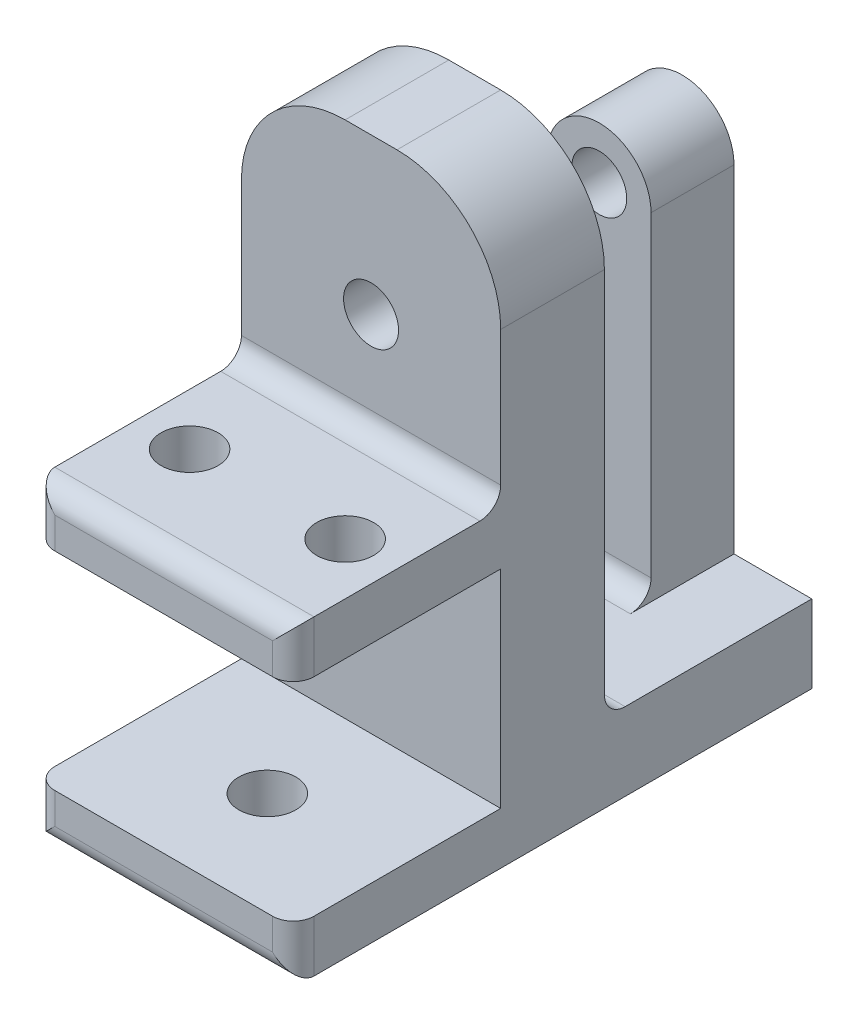
ISO-10303-21;
HEADER;
FILE_DESCRIPTION(('STEP AP214'),'2;1');
FILE_NAME('part.step','',(''),(''),'','','');
FILE_SCHEMA(('AUTOMOTIVE_DESIGN { 1 0 10303 214 1 1 1 1 }'));
ENDSEC;
DATA;
#1=APPLICATION_CONTEXT('core data for automotive mechanical design processes');
#2=APPLICATION_PROTOCOL_DEFINITION('international standard','automotive_design',2000,#1);
#3=PRODUCT_CONTEXT('',#1,'mechanical');
#4=PRODUCT('Part','Part','',(#3));
#5=PRODUCT_RELATED_PRODUCT_CATEGORY('part','',(#4));
#6=PRODUCT_DEFINITION_FORMATION('','',#4);
#7=PRODUCT_DEFINITION_CONTEXT('part definition',#1,'design');
#8=PRODUCT_DEFINITION('design','',#6,#7);
#9=PRODUCT_DEFINITION_SHAPE('','',#8);
#10=(LENGTH_UNIT() NAMED_UNIT(*) SI_UNIT(.MILLI.,.METRE.));
#11=(NAMED_UNIT(*) PLANE_ANGLE_UNIT() SI_UNIT($,.RADIAN.));
#12=(NAMED_UNIT(*) SI_UNIT($,.STERADIAN.) SOLID_ANGLE_UNIT());
#13=UNCERTAINTY_MEASURE_WITH_UNIT(LENGTH_MEASURE(1.E-05),#10,'distance_accuracy_value','');
#14=(GEOMETRIC_REPRESENTATION_CONTEXT(3) GLOBAL_UNCERTAINTY_ASSIGNED_CONTEXT((#13)) GLOBAL_UNIT_ASSIGNED_CONTEXT((#10,
#11,#12)) REPRESENTATION_CONTEXT('',''));
#15=CARTESIAN_POINT('',(0.,0.,0.));
#16=DIRECTION('',(0.,0.,1.));
#17=DIRECTION('',(1.,0.,0.));
#18=AXIS2_PLACEMENT_3D('',#15,#16,#17);
#19=CARTESIAN_POINT('',(10.,40.,10.));
#20=DIRECTION('',(0.,0.,-1.));
#21=DIRECTION('',(-1.,0.,0.));
#22=AXIS2_PLACEMENT_3D('',#19,#20,#21);
#23=PLANE('',#22);
#24=DIRECTION('',(1.,0.,0.));
#25=VECTOR('',#24,1.);
#26=CARTESIAN_POINT('',(0.,20.,10.));
#27=LINE('',#26,#25);
#28=CARTESIAN_POINT('',(0.,20.,10.));
#29=VERTEX_POINT('',#28);
#30=CARTESIAN_POINT('',(25.,20.,10.));
#31=VERTEX_POINT('',#30);
#32=EDGE_CURVE('E297',#29,#31,#27,.T.);
#33=ORIENTED_EDGE('',*,*,#32,.F.);
#34=DIRECTION('',(0.,-1.,0.));
#35=VECTOR('',#34,1.);
#36=CARTESIAN_POINT('',(0.,0.,10.));
#37=LINE('',#36,#35);
#38=CARTESIAN_POINT('',(0.,0.,10.));
#39=VERTEX_POINT('',#38);
#40=EDGE_CURVE('E315',#29,#39,#37,.T.);
#41=ORIENTED_EDGE('',*,*,#40,.T.);
#42=DIRECTION('',(1.,0.,0.));
#43=VECTOR('',#42,1.);
#44=CARTESIAN_POINT('',(0.,0.,10.));
#45=LINE('',#44,#43);
#46=CARTESIAN_POINT('',(25.,0.,10.));
#47=VERTEX_POINT('',#46);
#48=EDGE_CURVE('E314',#39,#47,#45,.T.);
#49=ORIENTED_EDGE('',*,*,#48,.T.);
#50=DIRECTION('',(0.,1.,0.));
#51=VECTOR('',#50,1.);
#52=CARTESIAN_POINT('',(25.,0.,10.));
#53=LINE('',#52,#51);
#54=EDGE_CURVE('E319',#47,#31,#53,.T.);
#55=ORIENTED_EDGE('',*,*,#54,.T.);
#56=EDGE_LOOP('',(#33,#41,#49,#55));
#57=FACE_BOUND('',#56,.T.);
#58=ADVANCED_FACE('F37',(#57),#23,.F.);
#59=CARTESIAN_POINT('',(0.,40.,10.));
#60=VERTEX_POINT('',#59);
#61=CARTESIAN_POINT('',(0.,27.,10.));
#62=VERTEX_POINT('',#61);
#63=EDGE_CURVE('E311',#60,#62,#37,.T.);
#64=ORIENTED_EDGE('',*,*,#63,.T.);
#65=DIRECTION('',(1.,0.,0.));
#66=VECTOR('',#65,1.);
#67=CARTESIAN_POINT('',(10.,27.,10.));
#68=LINE('',#67,#66);
#69=CARTESIAN_POINT('',(25.,27.,10.));
#70=VERTEX_POINT('',#69);
#71=EDGE_CURVE('E368',#62,#70,#68,.T.);
#72=ORIENTED_EDGE('',*,*,#71,.T.);
#73=CARTESIAN_POINT('',(25.,40.,10.));
#74=VERTEX_POINT('',#73);
#75=EDGE_CURVE('E318',#70,#74,#53,.T.);
#76=ORIENTED_EDGE('',*,*,#75,.T.);
#77=CARTESIAN_POINT('',(15.,40.,10.));
#78=DIRECTION('',(0.,0.,1.));
#79=DIRECTION('',(-1.,0.,0.));
#80=AXIS2_PLACEMENT_3D('',#77,#78,#79);
#81=CIRCLE('',#80,10.);
#82=CARTESIAN_POINT('',(15.,50.,10.));
#83=VERTEX_POINT('',#82);
#84=EDGE_CURVE('E322',#74,#83,#81,.T.);
#85=ORIENTED_EDGE('',*,*,#84,.T.);
#86=DIRECTION('',(-1.,0.,0.));
#87=VECTOR('',#86,1.);
#88=CARTESIAN_POINT('',(10.,50.,10.));
#89=LINE('',#88,#87);
#90=CARTESIAN_POINT('',(10.,50.,10.));
#91=VERTEX_POINT('',#90);
#92=EDGE_CURVE('E324',#83,#91,#89,.T.);
#93=ORIENTED_EDGE('',*,*,#92,.T.);
#94=CARTESIAN_POINT('',(10.,40.,10.));
#95=DIRECTION('',(0.,0.,1.));
#96=DIRECTION('',(-1.,0.,0.));
#97=AXIS2_PLACEMENT_3D('',#94,#95,#96);
#98=CIRCLE('',#97,10.);
#99=EDGE_CURVE('E326',#91,#60,#98,.T.);
#100=ORIENTED_EDGE('',*,*,#99,.T.);
#101=EDGE_LOOP('',(#64,#72,#76,#85,#93,#100));
#102=FACE_BOUND('',#101,.T.);
#103=CARTESIAN_POINT('',(12.5,35.,10.));
#104=DIRECTION('',(0.,0.,1.));
#105=DIRECTION('',(1.,0.,0.));
#106=AXIS2_PLACEMENT_3D('',#103,#104,#105);
#107=CIRCLE('',#106,2.65);
#108=CARTESIAN_POINT('',(15.15,35.,10.));
#109=VERTEX_POINT('',#108);
#110=EDGE_CURVE('E305',#109,#109,#107,.T.);
#111=ORIENTED_EDGE('',*,*,#110,.F.);
#112=EDGE_LOOP('',(#111));
#113=FACE_BOUND('',#112,.T.);
#114=ADVANCED_FACE('F501',(#102,#113),#23,.F.);
#115=CARTESIAN_POINT('',(10.,40.,0.));
#116=DIRECTION('',(0.,0.,-1.));
#117=DIRECTION('',(-1.,0.,0.));
#118=AXIS2_PLACEMENT_3D('',#115,#116,#117);
#119=PLANE('',#118);
#120=DIRECTION('',(0.,1.,0.));
#121=VECTOR('',#120,1.);
#122=CARTESIAN_POINT('',(25.,0.,0.));
#123=LINE('',#122,#121);
#124=CARTESIAN_POINT('',(25.,4.5,0.));
#125=VERTEX_POINT('',#124);
#126=CARTESIAN_POINT('',(25.,40.,0.));
#127=VERTEX_POINT('',#126);
#128=EDGE_CURVE('E331',#125,#127,#123,.T.);
#129=ORIENTED_EDGE('',*,*,#128,.F.);
#130=DIRECTION('',(1.,0.,0.));
#131=VECTOR('',#130,1.);
#132=CARTESIAN_POINT('',(10.,4.5,0.));
#133=LINE('',#132,#131);
#134=CARTESIAN_POINT('',(0.,4.5,0.));
#135=VERTEX_POINT('',#134);
#136=EDGE_CURVE('E356',#125,#135,#133,.F.);
#137=ORIENTED_EDGE('',*,*,#136,.T.);
#138=DIRECTION('',(0.,-1.,0.));
#139=VECTOR('',#138,1.);
#140=CARTESIAN_POINT('',(0.,0.,0.));
#141=LINE('',#140,#139);
#142=CARTESIAN_POINT('',(0.,40.,0.));
#143=VERTEX_POINT('',#142);
#144=EDGE_CURVE('E308',#143,#135,#141,.T.);
#145=ORIENTED_EDGE('',*,*,#144,.F.);
#146=CARTESIAN_POINT('',(10.,40.,0.));
#147=DIRECTION('',(0.,0.,1.));
#148=DIRECTION('',(-1.,0.,0.));
#149=AXIS2_PLACEMENT_3D('',#146,#147,#148);
#150=CIRCLE('',#149,10.);
#151=CARTESIAN_POINT('',(10.,50.,0.));
#152=VERTEX_POINT('',#151);
#153=EDGE_CURVE('E337',#152,#143,#150,.T.);
#154=ORIENTED_EDGE('',*,*,#153,.F.);
#155=DIRECTION('',(-1.,0.,0.));
#156=VECTOR('',#155,1.);
#157=CARTESIAN_POINT('',(10.,50.,0.));
#158=LINE('',#157,#156);
#159=CARTESIAN_POINT('',(15.,50.,0.));
#160=VERTEX_POINT('',#159);
#161=EDGE_CURVE('E335',#160,#152,#158,.T.);
#162=ORIENTED_EDGE('',*,*,#161,.F.);
#163=CARTESIAN_POINT('',(15.,40.,0.));
#164=DIRECTION('',(0.,0.,1.));
#165=DIRECTION('',(-1.,0.,0.));
#166=AXIS2_PLACEMENT_3D('',#163,#164,#165);
#167=CIRCLE('',#166,10.);
#168=EDGE_CURVE('E333',#127,#160,#167,.T.);
#169=ORIENTED_EDGE('',*,*,#168,.F.);
#170=EDGE_LOOP('',(#129,#137,#145,#154,#162,#169));
#171=FACE_BOUND('',#170,.T.);
#172=CARTESIAN_POINT('',(12.5,35.,0.));
#173=DIRECTION('',(0.,0.,1.));
#174=DIRECTION('',(1.,0.,0.));
#175=AXIS2_PLACEMENT_3D('',#172,#173,#174);
#176=CIRCLE('',#175,2.65);
#177=CARTESIAN_POINT('',(15.15,35.,0.));
#178=VERTEX_POINT('',#177);
#179=EDGE_CURVE('E295',#178,#178,#176,.T.);
#180=ORIENTED_EDGE('',*,*,#179,.T.);
#181=EDGE_LOOP('',(#180));
#182=FACE_BOUND('',#181,.T.);
#183=ADVANCED_FACE('F506',(#171,#182),#119,.T.);
#184=CARTESIAN_POINT('',(0.,0.,10.));
#185=DIRECTION('',(1.,0.,0.));
#186=DIRECTION('',(0.,0.,-1.));
#187=AXIS2_PLACEMENT_3D('',#184,#185,#186);
#188=PLANE('',#187);
#189=DIRECTION('',(0.,0.,-1.));
#190=VECTOR('',#189,1.);
#191=CARTESIAN_POINT('',(0.,20.,10.));
#192=LINE('',#191,#190);
#193=CARTESIAN_POINT('',(0.,20.,28.));
#194=VERTEX_POINT('',#193);
#195=EDGE_CURVE('E283',#194,#29,#192,.T.);
#196=ORIENTED_EDGE('',*,*,#195,.F.);
#197=DIRECTION('',(0.,-1.,0.));
#198=VECTOR('',#197,1.);
#199=CARTESIAN_POINT('',(0.,25.,28.));
#200=LINE('',#199,#198);
#201=CARTESIAN_POINT('',(0.,25.,28.));
#202=VERTEX_POINT('',#201);
#203=EDGE_CURVE('E400',#194,#202,#200,.F.);
#204=ORIENTED_EDGE('',*,*,#203,.T.);
#205=DIRECTION('',(0.,0.,-1.));
#206=VECTOR('',#205,1.);
#207=CARTESIAN_POINT('',(0.,25.,10.));
#208=LINE('',#207,#206);
#209=CARTESIAN_POINT('',(0.,25.,12.));
#210=VERTEX_POINT('',#209);
#211=EDGE_CURVE('E289',#202,#210,#208,.T.);
#212=ORIENTED_EDGE('',*,*,#211,.T.);
#213=CARTESIAN_POINT('',(0.,27.,12.));
#214=DIRECTION('',(1.,0.,0.));
#215=DIRECTION('',(0.,0.,-1.));
#216=AXIS2_PLACEMENT_3D('',#213,#214,#215);
#217=CIRCLE('',#216,2.);
#218=EDGE_CURVE('E384',#210,#62,#217,.T.);
#219=ORIENTED_EDGE('',*,*,#218,.T.);
#220=ORIENTED_EDGE('',*,*,#63,.F.);
#221=DIRECTION('',(0.,0.,-1.));
#222=VECTOR('',#221,1.);
#223=CARTESIAN_POINT('',(0.,40.,10.));
#224=LINE('',#223,#222);
#225=EDGE_CURVE('E328',#60,#143,#224,.T.);
#226=ORIENTED_EDGE('',*,*,#225,.T.);
#227=ORIENTED_EDGE('',*,*,#144,.T.);
#228=CARTESIAN_POINT('',(0.,4.5,-2.));
#229=DIRECTION('',(1.,0.,0.));
#230=DIRECTION('',(0.,0.,-1.));
#231=AXIS2_PLACEMENT_3D('',#228,#229,#230);
#232=CIRCLE('',#231,2.);
#233=CARTESIAN_POINT('',(0.,2.5,-2.));
#234=VERTEX_POINT('',#233);
#235=EDGE_CURVE('E362',#135,#234,#232,.T.);
#236=ORIENTED_EDGE('',*,*,#235,.T.);
#237=DIRECTION('',(0.,0.,1.));
#238=VECTOR('',#237,1.);
#239=CARTESIAN_POINT('',(0.,2.5,-20.));
#240=LINE('',#239,#238);
#241=CARTESIAN_POINT('',(0.,2.5,-20.));
#242=VERTEX_POINT('',#241);
#243=EDGE_CURVE('E273',#242,#234,#240,.T.);
#244=ORIENTED_EDGE('',*,*,#243,.F.);
#245=DIRECTION('',(0.,1.,0.));
#246=VECTOR('',#245,1.);
#247=CARTESIAN_POINT('',(0.,-5.,-20.));
#248=LINE('',#247,#246);
#249=CARTESIAN_POINT('',(0.,-5.,-20.));
#250=VERTEX_POINT('',#249);
#251=EDGE_CURVE('E264',#250,#242,#248,.T.);
#252=ORIENTED_EDGE('',*,*,#251,.F.);
#253=DIRECTION('',(0.,0.,-1.));
#254=VECTOR('',#253,1.);
#255=CARTESIAN_POINT('',(0.,-5.,10.));
#256=LINE('',#255,#254);
#257=CARTESIAN_POINT('',(0.,-5.,28.));
#258=VERTEX_POINT('',#257);
#259=EDGE_CURVE('E277',#258,#250,#256,.T.);
#260=ORIENTED_EDGE('',*,*,#259,.F.);
#261=DIRECTION('',(0.,1.,0.));
#262=VECTOR('',#261,1.);
#263=CARTESIAN_POINT('',(0.,0.,28.));
#264=LINE('',#263,#262);
#265=CARTESIAN_POINT('',(0.,0.,28.));
#266=VERTEX_POINT('',#265);
#267=EDGE_CURVE('E397',#258,#266,#264,.T.);
#268=ORIENTED_EDGE('',*,*,#267,.T.);
#269=DIRECTION('',(0.,0.,-1.));
#270=VECTOR('',#269,1.);
#271=CARTESIAN_POINT('',(0.,0.,30.));
#272=LINE('',#271,#270);
#273=EDGE_CURVE('E280',#266,#39,#272,.T.);
#274=ORIENTED_EDGE('',*,*,#273,.T.);
#275=ORIENTED_EDGE('',*,*,#40,.F.);
#276=EDGE_LOOP('',(#196,#204,#212,#219,#220,#226,#227,#236,#244,#252,#260,#268,#274,#275));
#277=FACE_BOUND('',#276,.T.);
#278=ADVANCED_FACE('F443',(#277),#188,.F.);
#279=CARTESIAN_POINT('',(25.,0.,10.));
#280=DIRECTION('',(-1.,0.,0.));
#281=DIRECTION('',(0.,-1.,0.));
#282=AXIS2_PLACEMENT_3D('',#279,#280,#281);
#283=PLANE('',#282);
#284=DIRECTION('',(0.,0.,1.));
#285=VECTOR('',#284,1.);
#286=CARTESIAN_POINT('',(25.,25.,10.));
#287=LINE('',#286,#285);
#288=CARTESIAN_POINT('',(25.,25.,12.));
#289=VERTEX_POINT('',#288);
#290=CARTESIAN_POINT('',(25.,25.,28.));
#291=VERTEX_POINT('',#290);
#292=EDGE_CURVE('E291',#289,#291,#287,.T.);
#293=ORIENTED_EDGE('',*,*,#292,.T.);
#294=DIRECTION('',(0.,-1.,0.));
#295=VECTOR('',#294,1.);
#296=CARTESIAN_POINT('',(25.,20.,28.));
#297=LINE('',#296,#295);
#298=CARTESIAN_POINT('',(25.,20.,28.));
#299=VERTEX_POINT('',#298);
#300=EDGE_CURVE('E404',#291,#299,#297,.T.);
#301=ORIENTED_EDGE('',*,*,#300,.T.);
#302=DIRECTION('',(0.,0.,1.));
#303=VECTOR('',#302,1.);
#304=CARTESIAN_POINT('',(25.,20.,10.));
#305=LINE('',#304,#303);
#306=EDGE_CURVE('E300',#31,#299,#305,.T.);
#307=ORIENTED_EDGE('',*,*,#306,.F.);
#308=ORIENTED_EDGE('',*,*,#54,.F.);
#309=DIRECTION('',(0.,0.,1.));
#310=VECTOR('',#309,1.);
#311=CARTESIAN_POINT('',(25.,0.,10.));
#312=LINE('',#311,#310);
#313=CARTESIAN_POINT('',(25.,0.,28.));
#314=VERTEX_POINT('',#313);
#315=EDGE_CURVE('E276',#47,#314,#312,.T.);
#316=ORIENTED_EDGE('',*,*,#315,.T.);
#317=DIRECTION('',(0.,1.,0.));
#318=VECTOR('',#317,1.);
#319=CARTESIAN_POINT('',(25.,0.,28.));
#320=LINE('',#319,#318);
#321=CARTESIAN_POINT('',(25.,-5.,28.));
#322=VERTEX_POINT('',#321);
#323=EDGE_CURVE('E402',#314,#322,#320,.F.);
#324=ORIENTED_EDGE('',*,*,#323,.T.);
#325=DIRECTION('',(0.,0.,1.));
#326=VECTOR('',#325,1.);
#327=CARTESIAN_POINT('',(25.,-5.,0.));
#328=LINE('',#327,#326);
#329=CARTESIAN_POINT('',(25.,-5.,-20.));
#330=VERTEX_POINT('',#329);
#331=EDGE_CURVE('E279',#330,#322,#328,.T.);
#332=ORIENTED_EDGE('',*,*,#331,.F.);
#333=DIRECTION('',(0.,-1.,0.));
#334=VECTOR('',#333,1.);
#335=CARTESIAN_POINT('',(25.,-5.,-20.));
#336=LINE('',#335,#334);
#337=CARTESIAN_POINT('',(25.,2.5,-20.));
#338=VERTEX_POINT('',#337);
#339=EDGE_CURVE('E256',#338,#330,#336,.T.);
#340=ORIENTED_EDGE('',*,*,#339,.F.);
#341=DIRECTION('',(0.,0.,1.));
#342=VECTOR('',#341,1.);
#343=CARTESIAN_POINT('',(25.,2.5,-20.));
#344=LINE('',#343,#342);
#345=CARTESIAN_POINT('',(25.,2.5,-2.));
#346=VERTEX_POINT('',#345);
#347=EDGE_CURVE('E270',#338,#346,#344,.T.);
#348=ORIENTED_EDGE('',*,*,#347,.T.);
#349=CARTESIAN_POINT('',(25.,4.5,-2.));
#350=DIRECTION('',(-1.,0.,0.));
#351=DIRECTION('',(0.,-1.,0.));
#352=AXIS2_PLACEMENT_3D('',#349,#350,#351);
#353=CIRCLE('',#352,2.);
#354=EDGE_CURVE('E360',#346,#125,#353,.T.);
#355=ORIENTED_EDGE('',*,*,#354,.T.);
#356=ORIENTED_EDGE('',*,*,#128,.T.);
#357=DIRECTION('',(0.,0.,-1.));
#358=VECTOR('',#357,1.);
#359=CARTESIAN_POINT('',(25.,40.,10.));
#360=LINE('',#359,#358);
#361=EDGE_CURVE('E347',#74,#127,#360,.T.);
#362=ORIENTED_EDGE('',*,*,#361,.F.);
#363=ORIENTED_EDGE('',*,*,#75,.F.);
#364=CARTESIAN_POINT('',(25.,27.,12.));
#365=DIRECTION('',(-1.,0.,0.));
#366=DIRECTION('',(0.,-1.,0.));
#367=AXIS2_PLACEMENT_3D('',#364,#365,#366);
#368=CIRCLE('',#367,2.);
#369=EDGE_CURVE('E382',#70,#289,#368,.T.);
#370=ORIENTED_EDGE('',*,*,#369,.T.);
#371=EDGE_LOOP('',(#293,#301,#307,#308,#316,#324,#332,#340,#348,#355,#356,#362,#363,#370));
#372=FACE_BOUND('',#371,.T.);
#373=ADVANCED_FACE('F456',(#372),#283,.F.);
#374=CARTESIAN_POINT('',(15.,40.,10.));
#375=DIRECTION('',(0.,0.,-1.));
#376=DIRECTION('',(-1.,0.,0.));
#377=AXIS2_PLACEMENT_3D('',#374,#375,#376);
#378=CYLINDRICAL_SURFACE('',#377,10.);
#379=ORIENTED_EDGE('',*,*,#168,.T.);
#380=DIRECTION('',(0.,0.,-1.));
#381=VECTOR('',#380,1.);
#382=CARTESIAN_POINT('',(15.,50.,10.));
#383=LINE('',#382,#381);
#384=EDGE_CURVE('E344',#83,#160,#383,.T.);
#385=ORIENTED_EDGE('',*,*,#384,.F.);
#386=ORIENTED_EDGE('',*,*,#84,.F.);
#387=ORIENTED_EDGE('',*,*,#361,.T.);
#388=EDGE_LOOP('',(#379,#385,#386,#387));
#389=FACE_BOUND('',#388,.T.);
#390=ADVANCED_FACE('F518',(#389),#378,.T.);
#391=CARTESIAN_POINT('',(10.,50.,10.));
#392=DIRECTION('',(0.,-1.,0.));
#393=DIRECTION('',(0.,0.,-1.));
#394=AXIS2_PLACEMENT_3D('',#391,#392,#393);
#395=PLANE('',#394);
#396=ORIENTED_EDGE('',*,*,#161,.T.);
#397=DIRECTION('',(0.,0.,-1.));
#398=VECTOR('',#397,1.);
#399=CARTESIAN_POINT('',(10.,50.,10.));
#400=LINE('',#399,#398);
#401=EDGE_CURVE('E341',#91,#152,#400,.T.);
#402=ORIENTED_EDGE('',*,*,#401,.F.);
#403=ORIENTED_EDGE('',*,*,#92,.F.);
#404=ORIENTED_EDGE('',*,*,#384,.T.);
#405=EDGE_LOOP('',(#396,#402,#403,#404));
#406=FACE_BOUND('',#405,.T.);
#407=ADVANCED_FACE('F514',(#406),#395,.F.);
#408=CARTESIAN_POINT('',(10.,40.,10.));
#409=DIRECTION('',(0.,0.,-1.));
#410=DIRECTION('',(-1.,0.,0.));
#411=AXIS2_PLACEMENT_3D('',#408,#409,#410);
#412=CYLINDRICAL_SURFACE('',#411,10.);
#413=ORIENTED_EDGE('',*,*,#153,.T.);
#414=ORIENTED_EDGE('',*,*,#225,.F.);
#415=ORIENTED_EDGE('',*,*,#99,.F.);
#416=ORIENTED_EDGE('',*,*,#401,.T.);
#417=EDGE_LOOP('',(#413,#414,#415,#416));
#418=FACE_BOUND('',#417,.T.);
#419=ADVANCED_FACE('F496',(#418),#412,.T.);
#420=CARTESIAN_POINT('',(12.5,35.,10.));
#421=DIRECTION('',(0.,0.,-1.));
#422=DIRECTION('',(-1.,0.,0.));
#423=AXIS2_PLACEMENT_3D('',#420,#421,#422);
#424=CYLINDRICAL_SURFACE('',#423,2.65);
#425=ORIENTED_EDGE('',*,*,#110,.T.);
#426=EDGE_LOOP('',(#425));
#427=FACE_BOUND('',#426,.T.);
#428=ORIENTED_EDGE('',*,*,#179,.F.);
#429=EDGE_LOOP('',(#428));
#430=FACE_BOUND('',#429,.T.);
#431=ADVANCED_FACE('F488',(#427,#430),#424,.F.);
#432=CARTESIAN_POINT('',(0.,25.,30.));
#433=DIRECTION('',(0.,0.,1.));
#434=DIRECTION('',(1.,0.,0.));
#435=AXIS2_PLACEMENT_3D('',#432,#433,#434);
#436=PLANE('',#435);
#437=DIRECTION('',(-1.,0.,0.));
#438=VECTOR('',#437,1.);
#439=CARTESIAN_POINT('',(0.,23.,30.));
#440=LINE('',#439,#438);
#441=CARTESIAN_POINT('',(23.,23.,30.));
#442=VERTEX_POINT('',#441);
#443=CARTESIAN_POINT('',(2.,23.,30.));
#444=VERTEX_POINT('',#443);
#445=EDGE_CURVE('E386',#442,#444,#440,.T.);
#446=ORIENTED_EDGE('',*,*,#445,.T.);
#447=DIRECTION('',(0.,-1.,0.));
#448=VECTOR('',#447,1.);
#449=CARTESIAN_POINT('',(2.,20.,30.));
#450=LINE('',#449,#448);
#451=CARTESIAN_POINT('',(2.,20.,30.));
#452=VERTEX_POINT('',#451);
#453=EDGE_CURVE('E390',#444,#452,#450,.T.);
#454=ORIENTED_EDGE('',*,*,#453,.T.);
#455=DIRECTION('',(-1.,0.,0.));
#456=VECTOR('',#455,1.);
#457=CARTESIAN_POINT('',(0.,20.,30.));
#458=LINE('',#457,#456);
#459=CARTESIAN_POINT('',(23.,20.,30.));
#460=VERTEX_POINT('',#459);
#461=EDGE_CURVE('E292',#460,#452,#458,.T.);
#462=ORIENTED_EDGE('',*,*,#461,.F.);
#463=DIRECTION('',(0.,-1.,0.));
#464=VECTOR('',#463,1.);
#465=CARTESIAN_POINT('',(23.,25.,30.));
#466=LINE('',#465,#464);
#467=EDGE_CURVE('E388',#460,#442,#466,.F.);
#468=ORIENTED_EDGE('',*,*,#467,.T.);
#469=EDGE_LOOP('',(#446,#454,#462,#468));
#470=FACE_BOUND('',#469,.T.);
#471=ADVANCED_FACE('F486',(#470),#436,.T.);
#472=CARTESIAN_POINT('',(0.,25.,0.));
#473=DIRECTION('',(0.,1.,0.));
#474=DIRECTION('',(0.,0.,1.));
#475=AXIS2_PLACEMENT_3D('',#472,#473,#474);
#476=PLANE('',#475);
#477=CARTESIAN_POINT('',(5.,25.,20.));
#478=DIRECTION('',(0.,1.,0.));
#479=DIRECTION('',(0.,0.,1.));
#480=AXIS2_PLACEMENT_3D('',#477,#478,#479);
#481=CIRCLE('',#480,2.75);
#482=CARTESIAN_POINT('',(5.,25.,22.75));
#483=VERTEX_POINT('',#482);
#484=EDGE_CURVE('E240',#483,#483,#481,.T.);
#485=ORIENTED_EDGE('',*,*,#484,.F.);
#486=EDGE_LOOP('',(#485));
#487=FACE_BOUND('',#486,.T.);
#488=CARTESIAN_POINT('',(20.,25.,20.));
#489=DIRECTION('',(0.,1.,0.));
#490=DIRECTION('',(0.,0.,1.));
#491=AXIS2_PLACEMENT_3D('',#488,#489,#490);
#492=CIRCLE('',#491,2.75);
#493=CARTESIAN_POINT('',(20.,25.,22.75));
#494=VERTEX_POINT('',#493);
#495=EDGE_CURVE('E244',#494,#494,#492,.T.);
#496=ORIENTED_EDGE('',*,*,#495,.F.);
#497=EDGE_LOOP('',(#496));
#498=FACE_BOUND('',#497,.T.);
#499=ORIENTED_EDGE('',*,*,#211,.F.);
#500=DIRECTION('',(-1.,0.,0.));
#501=VECTOR('',#500,1.);
#502=CARTESIAN_POINT('',(0.,25.,28.));
#503=LINE('',#502,#501);
#504=EDGE_CURVE('E11',#202,#291,#503,.F.);
#505=ORIENTED_EDGE('',*,*,#504,.T.);
#506=ORIENTED_EDGE('',*,*,#292,.F.);
#507=DIRECTION('',(1.,0.,0.));
#508=VECTOR('',#507,1.);
#509=CARTESIAN_POINT('',(0.,25.,12.));
#510=LINE('',#509,#508);
#511=EDGE_CURVE('E379',#289,#210,#510,.F.);
#512=ORIENTED_EDGE('',*,*,#511,.T.);
#513=EDGE_LOOP('',(#499,#505,#506,#512));
#514=FACE_BOUND('',#513,.T.);
#515=ADVANCED_FACE('F475',(#487,#498,#514),#476,.T.);
#516=CARTESIAN_POINT('',(0.,20.,0.));
#517=DIRECTION('',(0.,1.,0.));
#518=DIRECTION('',(0.,0.,1.));
#519=AXIS2_PLACEMENT_3D('',#516,#517,#518);
#520=PLANE('',#519);
#521=CARTESIAN_POINT('',(5.,20.,20.));
#522=DIRECTION('',(0.,1.,0.));
#523=DIRECTION('',(0.,0.,1.));
#524=AXIS2_PLACEMENT_3D('',#521,#522,#523);
#525=CIRCLE('',#524,2.75);
#526=CARTESIAN_POINT('',(5.,20.,22.75));
#527=VERTEX_POINT('',#526);
#528=EDGE_CURVE('E251',#527,#527,#525,.T.);
#529=ORIENTED_EDGE('',*,*,#528,.T.);
#530=EDGE_LOOP('',(#529));
#531=FACE_BOUND('',#530,.T.);
#532=CARTESIAN_POINT('',(20.,20.,20.));
#533=DIRECTION('',(0.,1.,0.));
#534=DIRECTION('',(0.,0.,1.));
#535=AXIS2_PLACEMENT_3D('',#532,#533,#534);
#536=CIRCLE('',#535,2.75);
#537=CARTESIAN_POINT('',(20.,20.,22.75));
#538=VERTEX_POINT('',#537);
#539=EDGE_CURVE('E243',#538,#538,#536,.T.);
#540=ORIENTED_EDGE('',*,*,#539,.T.);
#541=EDGE_LOOP('',(#540));
#542=FACE_BOUND('',#541,.T.);
#543=ORIENTED_EDGE('',*,*,#461,.T.);
#544=CARTESIAN_POINT('',(2.,20.,28.));
#545=DIRECTION('',(0.,1.,0.));
#546=DIRECTION('',(0.,0.,1.));
#547=AXIS2_PLACEMENT_3D('',#544,#545,#546);
#548=CIRCLE('',#547,2.);
#549=EDGE_CURVE('E395',#452,#194,#548,.F.);
#550=ORIENTED_EDGE('',*,*,#549,.T.);
#551=ORIENTED_EDGE('',*,*,#195,.T.);
#552=ORIENTED_EDGE('',*,*,#32,.T.);
#553=ORIENTED_EDGE('',*,*,#306,.T.);
#554=CARTESIAN_POINT('',(23.,20.,28.));
#555=DIRECTION('',(0.,1.,0.));
#556=DIRECTION('',(0.,0.,1.));
#557=AXIS2_PLACEMENT_3D('',#554,#555,#556);
#558=CIRCLE('',#557,2.);
#559=EDGE_CURVE('E393',#299,#460,#558,.F.);
#560=ORIENTED_EDGE('',*,*,#559,.T.);
#561=EDGE_LOOP('',(#543,#550,#551,#552,#553,#560));
#562=FACE_BOUND('',#561,.T.);
#563=ADVANCED_FACE('F484',(#531,#542,#562),#520,.F.);
#564=CARTESIAN_POINT('',(25.,-5.,30.));
#565=DIRECTION('',(0.,0.,-1.));
#566=DIRECTION('',(-1.,0.,0.));
#567=AXIS2_PLACEMENT_3D('',#564,#565,#566);
#568=PLANE('',#567);
#569=DIRECTION('',(-1.,0.,0.));
#570=VECTOR('',#569,1.);
#571=CARTESIAN_POINT('',(25.,0.,30.));
#572=LINE('',#571,#570);
#573=CARTESIAN_POINT('',(23.,0.,30.));
#574=VERTEX_POINT('',#573);
#575=CARTESIAN_POINT('',(2.,0.,30.));
#576=VERTEX_POINT('',#575);
#577=EDGE_CURVE('E286',#574,#576,#572,.T.);
#578=ORIENTED_EDGE('',*,*,#577,.T.);
#579=DIRECTION('',(0.,1.,0.));
#580=VECTOR('',#579,1.);
#581=CARTESIAN_POINT('',(2.,-5.,30.));
#582=LINE('',#581,#580);
#583=CARTESIAN_POINT('',(2.,-3.,30.));
#584=VERTEX_POINT('',#583);
#585=EDGE_CURVE('E59',#576,#584,#582,.F.);
#586=ORIENTED_EDGE('',*,*,#585,.T.);
#587=DIRECTION('',(-1.,0.,0.));
#588=VECTOR('',#587,1.);
#589=CARTESIAN_POINT('',(25.,-3.,30.));
#590=LINE('',#589,#588);
#591=CARTESIAN_POINT('',(23.,-3.,30.));
#592=VERTEX_POINT('',#591);
#593=EDGE_CURVE('E54',#584,#592,#590,.F.);
#594=ORIENTED_EDGE('',*,*,#593,.T.);
#595=DIRECTION('',(0.,1.,0.));
#596=VECTOR('',#595,1.);
#597=CARTESIAN_POINT('',(23.,-5.,30.));
#598=LINE('',#597,#596);
#599=EDGE_CURVE('E411',#592,#574,#598,.T.);
#600=ORIENTED_EDGE('',*,*,#599,.T.);
#601=EDGE_LOOP('',(#578,#586,#594,#600));
#602=FACE_BOUND('',#601,.T.);
#603=ADVANCED_FACE('F434',(#602),#568,.F.);
#604=CARTESIAN_POINT('',(0.,-5.,0.));
#605=DIRECTION('',(0.,-1.,0.));
#606=DIRECTION('',(0.,0.,-1.));
#607=AXIS2_PLACEMENT_3D('',#604,#605,#606);
#608=PLANE('',#607);
#609=CARTESIAN_POINT('',(12.5,-5.,20.));
#610=DIRECTION('',(0.,-1.,0.));
#611=DIRECTION('',(0.,0.,-1.));
#612=AXIS2_PLACEMENT_3D('',#609,#610,#611);
#613=CIRCLE('',#612,2.75);
#614=CARTESIAN_POINT('',(12.5,-5.,17.25));
#615=VERTEX_POINT('',#614);
#616=EDGE_CURVE('E235',#615,#615,#613,.T.);
#617=ORIENTED_EDGE('',*,*,#616,.F.);
#618=EDGE_LOOP('',(#617));
#619=FACE_BOUND('',#618,.T.);
#620=ORIENTED_EDGE('',*,*,#331,.T.);
#621=DIRECTION('',(-1.,0.,0.));
#622=VECTOR('',#621,1.);
#623=CARTESIAN_POINT('',(0.,-5.,28.));
#624=LINE('',#623,#622);
#625=EDGE_CURVE('E46',#322,#258,#624,.T.);
#626=ORIENTED_EDGE('',*,*,#625,.T.);
#627=ORIENTED_EDGE('',*,*,#259,.T.);
#628=DIRECTION('',(-1.,0.,0.));
#629=VECTOR('',#628,1.);
#630=CARTESIAN_POINT('',(25.,-5.,-20.));
#631=LINE('',#630,#629);
#632=EDGE_CURVE('E261',#330,#250,#631,.T.);
#633=ORIENTED_EDGE('',*,*,#632,.F.);
#634=EDGE_LOOP('',(#620,#626,#627,#633));
#635=FACE_BOUND('',#634,.T.);
#636=ADVANCED_FACE('F449',(#619,#635),#608,.T.);
#637=CARTESIAN_POINT('',(0.,0.,0.));
#638=DIRECTION('',(0.,-1.,0.));
#639=DIRECTION('',(0.,0.,-1.));
#640=AXIS2_PLACEMENT_3D('',#637,#638,#639);
#641=PLANE('',#640);
#642=CARTESIAN_POINT('',(12.5,0.,20.));
#643=DIRECTION('',(0.,-1.,0.));
#644=DIRECTION('',(0.,0.,-1.));
#645=AXIS2_PLACEMENT_3D('',#642,#643,#644);
#646=CIRCLE('',#645,2.75);
#647=CARTESIAN_POINT('',(12.5,0.,17.25));
#648=VERTEX_POINT('',#647);
#649=EDGE_CURVE('E239',#648,#648,#646,.T.);
#650=ORIENTED_EDGE('',*,*,#649,.T.);
#651=EDGE_LOOP('',(#650));
#652=FACE_BOUND('',#651,.T.);
#653=ORIENTED_EDGE('',*,*,#273,.F.);
#654=CARTESIAN_POINT('',(2.,0.,28.));
#655=DIRECTION('',(0.,-1.,0.));
#656=DIRECTION('',(0.,0.,-1.));
#657=AXIS2_PLACEMENT_3D('',#654,#655,#656);
#658=CIRCLE('',#657,2.);
#659=EDGE_CURVE('E408',#266,#576,#658,.F.);
#660=ORIENTED_EDGE('',*,*,#659,.T.);
#661=ORIENTED_EDGE('',*,*,#577,.F.);
#662=CARTESIAN_POINT('',(23.,0.,28.));
#663=DIRECTION('',(0.,-1.,0.));
#664=DIRECTION('',(0.,0.,-1.));
#665=AXIS2_PLACEMENT_3D('',#662,#663,#664);
#666=CIRCLE('',#665,2.);
#667=EDGE_CURVE('E406',#574,#314,#666,.F.);
#668=ORIENTED_EDGE('',*,*,#667,.T.);
#669=ORIENTED_EDGE('',*,*,#315,.F.);
#670=ORIENTED_EDGE('',*,*,#48,.F.);
#671=EDGE_LOOP('',(#653,#660,#661,#668,#669,#670));
#672=FACE_BOUND('',#671,.T.);
#673=ADVANCED_FACE('F437',(#652,#672),#641,.F.);
#674=CARTESIAN_POINT('',(25.,2.5,-20.));
#675=DIRECTION('',(0.,-1.,0.));
#676=DIRECTION('',(1.,0.,0.));
#677=AXIS2_PLACEMENT_3D('',#674,#675,#676);
#678=PLANE('',#677);
#679=ORIENTED_EDGE('',*,*,#243,.T.);
#680=DIRECTION('',(1.,0.,0.));
#681=VECTOR('',#680,1.);
#682=CARTESIAN_POINT('',(25.,2.5,-2.));
#683=LINE('',#682,#681);
#684=EDGE_CURVE('E353',#234,#346,#683,.T.);
#685=ORIENTED_EDGE('',*,*,#684,.T.);
#686=ORIENTED_EDGE('',*,*,#347,.F.);
#687=DIRECTION('',(1.,0.,0.));
#688=VECTOR('',#687,1.);
#689=CARTESIAN_POINT('',(25.,2.5,-20.));
#690=LINE('',#689,#688);
#691=CARTESIAN_POINT('',(17.5,2.5,-20.));
#692=VERTEX_POINT('',#691);
#693=EDGE_CURVE('E266',#692,#338,#690,.T.);
#694=ORIENTED_EDGE('',*,*,#693,.F.);
#695=DIRECTION('',(0.,0.,-1.));
#696=VECTOR('',#695,1.);
#697=CARTESIAN_POINT('',(17.5,2.5,-12.));
#698=LINE('',#697,#696);
#699=CARTESIAN_POINT('',(17.5,2.5,-10.));
#700=VERTEX_POINT('',#699);
#701=EDGE_CURVE('E253',#700,#692,#698,.T.);
#702=ORIENTED_EDGE('',*,*,#701,.F.);
#703=DIRECTION('',(-1.,0.,0.));
#704=VECTOR('',#703,1.);
#705=CARTESIAN_POINT('',(7.5,2.5,-10.));
#706=LINE('',#705,#704);
#707=CARTESIAN_POINT('',(7.5,2.5,-10.));
#708=VERTEX_POINT('',#707);
#709=EDGE_CURVE('E350',#700,#708,#706,.T.);
#710=ORIENTED_EDGE('',*,*,#709,.T.);
#711=DIRECTION('',(0.,0.,-1.));
#712=VECTOR('',#711,1.);
#713=CARTESIAN_POINT('',(7.5,2.5,-12.));
#714=LINE('',#713,#712);
#715=CARTESIAN_POINT('',(7.5,2.5,-20.));
#716=VERTEX_POINT('',#715);
#717=EDGE_CURVE('E248',#708,#716,#714,.T.);
#718=ORIENTED_EDGE('',*,*,#717,.T.);
#719=EDGE_CURVE('E267',#242,#716,#690,.T.);
#720=ORIENTED_EDGE('',*,*,#719,.F.);
#721=EDGE_LOOP('',(#679,#685,#686,#694,#702,#710,#718,#720));
#722=FACE_BOUND('',#721,.T.);
#723=ADVANCED_FACE('F645',(#722),#678,.F.);
#724=CARTESIAN_POINT('',(0.,0.,-20.));
#725=DIRECTION('',(0.,0.,1.));
#726=DIRECTION('',(1.,0.,0.));
#727=AXIS2_PLACEMENT_3D('',#724,#725,#726);
#728=PLANE('',#727);
#729=CARTESIAN_POINT('',(12.5,35.,-20.));
#730=DIRECTION('',(0.,0.,-1.));
#731=DIRECTION('',(-1.,0.,0.));
#732=AXIS2_PLACEMENT_3D('',#729,#730,#731);
#733=CIRCLE('',#732,2.65);
#734=CARTESIAN_POINT('',(9.85,35.,-20.));
#735=VERTEX_POINT('',#734);
#736=EDGE_CURVE('E233',#735,#735,#733,.T.);
#737=ORIENTED_EDGE('',*,*,#736,.F.);
#738=EDGE_LOOP('',(#737));
#739=FACE_BOUND('',#738,.T.);
#740=ORIENTED_EDGE('',*,*,#339,.T.);
#741=ORIENTED_EDGE('',*,*,#632,.T.);
#742=ORIENTED_EDGE('',*,*,#251,.T.);
#743=ORIENTED_EDGE('',*,*,#719,.T.);
#744=DIRECTION('',(0.,1.,0.));
#745=VECTOR('',#744,1.);
#746=CARTESIAN_POINT('',(7.5,2.5,-20.));
#747=LINE('',#746,#745);
#748=CARTESIAN_POINT('',(7.50000000000001,35.,-20.));
#749=VERTEX_POINT('',#748);
#750=EDGE_CURVE('E249',#716,#749,#747,.T.);
#751=ORIENTED_EDGE('',*,*,#750,.T.);
#752=CARTESIAN_POINT('',(12.5,35.,-20.));
#753=DIRECTION('',(0.,0.,-1.));
#754=DIRECTION('',(1.,0.,0.));
#755=AXIS2_PLACEMENT_3D('',#752,#753,#754);
#756=CIRCLE('',#755,4.99999999999999);
#757=CARTESIAN_POINT('',(17.5,35.,-20.));
#758=VERTEX_POINT('',#757);
#759=EDGE_CURVE('E223',#749,#758,#756,.T.);
#760=ORIENTED_EDGE('',*,*,#759,.T.);
#761=DIRECTION('',(0.,-1.,0.));
#762=VECTOR('',#761,1.);
#763=CARTESIAN_POINT('',(17.5,2.5,-20.));
#764=LINE('',#763,#762);
#765=EDGE_CURVE('E215',#758,#692,#764,.T.);
#766=ORIENTED_EDGE('',*,*,#765,.T.);
#767=ORIENTED_EDGE('',*,*,#693,.T.);
#768=EDGE_LOOP('',(#740,#741,#742,#743,#751,#760,#766,#767));
#769=FACE_BOUND('',#768,.T.);
#770=ADVANCED_FACE('F451',(#739,#769),#728,.F.);
#771=CARTESIAN_POINT('',(17.5,2.5,-12.));
#772=DIRECTION('',(1.,0.,0.));
#773=DIRECTION('',(0.,0.,-1.));
#774=AXIS2_PLACEMENT_3D('',#771,#772,#773);
#775=PLANE('',#774);
#776=ORIENTED_EDGE('',*,*,#765,.F.);
#777=DIRECTION('',(0.,0.,-1.));
#778=VECTOR('',#777,1.);
#779=CARTESIAN_POINT('',(17.5,35.,-12.));
#780=LINE('',#779,#778);
#781=CARTESIAN_POINT('',(17.5,35.,-12.));
#782=VERTEX_POINT('',#781);
#783=EDGE_CURVE('E224',#782,#758,#780,.T.);
#784=ORIENTED_EDGE('',*,*,#783,.F.);
#785=DIRECTION('',(0.,-1.,0.));
#786=VECTOR('',#785,1.);
#787=CARTESIAN_POINT('',(17.5,2.5,-12.));
#788=LINE('',#787,#786);
#789=CARTESIAN_POINT('',(17.5,4.5,-12.));
#790=VERTEX_POINT('',#789);
#791=EDGE_CURVE('E214',#782,#790,#788,.T.);
#792=ORIENTED_EDGE('',*,*,#791,.T.);
#793=CARTESIAN_POINT('',(17.5,4.5,-10.));
#794=DIRECTION('',(1.,0.,0.));
#795=DIRECTION('',(0.,0.,-1.));
#796=AXIS2_PLACEMENT_3D('',#793,#794,#795);
#797=CIRCLE('',#796,2.);
#798=EDGE_CURVE('E365',#790,#700,#797,.F.);
#799=ORIENTED_EDGE('',*,*,#798,.T.);
#800=ORIENTED_EDGE('',*,*,#701,.T.);
#801=EDGE_LOOP('',(#776,#784,#792,#799,#800));
#802=FACE_BOUND('',#801,.T.);
#803=ADVANCED_FACE('F633',(#802),#775,.T.);
#804=CARTESIAN_POINT('',(7.5,2.5,-12.));
#805=DIRECTION('',(-1.,0.,0.));
#806=DIRECTION('',(0.,-1.,0.));
#807=AXIS2_PLACEMENT_3D('',#804,#805,#806);
#808=PLANE('',#807);
#809=ORIENTED_EDGE('',*,*,#750,.F.);
#810=ORIENTED_EDGE('',*,*,#717,.F.);
#811=CARTESIAN_POINT('',(7.5,4.5,-10.));
#812=DIRECTION('',(-1.,0.,0.));
#813=DIRECTION('',(0.,-1.,0.));
#814=AXIS2_PLACEMENT_3D('',#811,#812,#813);
#815=CIRCLE('',#814,2.);
#816=CARTESIAN_POINT('',(7.5,4.5,-12.));
#817=VERTEX_POINT('',#816);
#818=EDGE_CURVE('E210',#708,#817,#815,.F.);
#819=ORIENTED_EDGE('',*,*,#818,.T.);
#820=DIRECTION('',(0.,1.,0.));
#821=VECTOR('',#820,1.);
#822=CARTESIAN_POINT('',(7.5,2.5,-12.));
#823=LINE('',#822,#821);
#824=CARTESIAN_POINT('',(7.50000000000001,35.,-12.));
#825=VERTEX_POINT('',#824);
#826=EDGE_CURVE('E204',#817,#825,#823,.T.);
#827=ORIENTED_EDGE('',*,*,#826,.T.);
#828=DIRECTION('',(0.,0.,-1.));
#829=VECTOR('',#828,1.);
#830=CARTESIAN_POINT('',(7.50000000000001,35.,-12.));
#831=LINE('',#830,#829);
#832=EDGE_CURVE('E207',#825,#749,#831,.T.);
#833=ORIENTED_EDGE('',*,*,#832,.T.);
#834=EDGE_LOOP('',(#809,#810,#819,#827,#833));
#835=FACE_BOUND('',#834,.T.);
#836=ADVANCED_FACE('F206',(#835),#808,.T.);
#837=CARTESIAN_POINT('',(0.,0.,-12.));
#838=DIRECTION('',(0.,0.,-1.));
#839=DIRECTION('',(-1.,0.,0.));
#840=AXIS2_PLACEMENT_3D('',#837,#838,#839);
#841=PLANE('',#840);
#842=CARTESIAN_POINT('',(12.5,35.,-12.));
#843=DIRECTION('',(0.,0.,-1.));
#844=DIRECTION('',(-1.,0.,0.));
#845=AXIS2_PLACEMENT_3D('',#842,#843,#844);
#846=CIRCLE('',#845,2.65);
#847=CARTESIAN_POINT('',(9.85,35.,-12.));
#848=VERTEX_POINT('',#847);
#849=EDGE_CURVE('E230',#848,#848,#846,.T.);
#850=ORIENTED_EDGE('',*,*,#849,.T.);
#851=EDGE_LOOP('',(#850));
#852=FACE_BOUND('',#851,.T.);
#853=ORIENTED_EDGE('',*,*,#826,.F.);
#854=DIRECTION('',(-1.,0.,0.));
#855=VECTOR('',#854,1.);
#856=CARTESIAN_POINT('',(17.5,4.5,-12.));
#857=LINE('',#856,#855);
#858=EDGE_CURVE('E358',#817,#790,#857,.F.);
#859=ORIENTED_EDGE('',*,*,#858,.T.);
#860=ORIENTED_EDGE('',*,*,#791,.F.);
#861=CARTESIAN_POINT('',(12.5,35.,-12.));
#862=DIRECTION('',(0.,0.,-1.));
#863=DIRECTION('',(1.,0.,0.));
#864=AXIS2_PLACEMENT_3D('',#861,#862,#863);
#865=CIRCLE('',#864,4.99999999999999);
#866=EDGE_CURVE('E221',#825,#782,#865,.T.);
#867=ORIENTED_EDGE('',*,*,#866,.F.);
#868=EDGE_LOOP('',(#853,#859,#860,#867));
#869=FACE_BOUND('',#868,.T.);
#870=ADVANCED_FACE('F226',(#852,#869),#841,.F.);
#871=CARTESIAN_POINT('',(25.,4.5,-2.));
#872=DIRECTION('',(1.,0.,0.));
#873=DIRECTION('',(0.,1.,0.));
#874=AXIS2_PLACEMENT_3D('',#871,#872,#873);
#875=CYLINDRICAL_SURFACE('',#874,2.);
#876=ORIENTED_EDGE('',*,*,#235,.F.);
#877=ORIENTED_EDGE('',*,*,#136,.F.);
#878=ORIENTED_EDGE('',*,*,#354,.F.);
#879=ORIENTED_EDGE('',*,*,#684,.F.);
#880=EDGE_LOOP('',(#876,#877,#878,#879));
#881=FACE_BOUND('',#880,.T.);
#882=ADVANCED_FACE('F527',(#881),#875,.F.);
#883=CARTESIAN_POINT('',(25.,4.5,-10.));
#884=DIRECTION('',(1.,0.,0.));
#885=DIRECTION('',(0.,1.,0.));
#886=AXIS2_PLACEMENT_3D('',#883,#884,#885);
#887=CYLINDRICAL_SURFACE('',#886,2.);
#888=ORIENTED_EDGE('',*,*,#798,.F.);
#889=ORIENTED_EDGE('',*,*,#858,.F.);
#890=ORIENTED_EDGE('',*,*,#818,.F.);
#891=ORIENTED_EDGE('',*,*,#709,.F.);
#892=EDGE_LOOP('',(#888,#889,#890,#891));
#893=FACE_BOUND('',#892,.T.);
#894=ADVANCED_FACE('F530',(#893),#887,.F.);
#895=CARTESIAN_POINT('',(20.,19.,20.));
#896=DIRECTION('',(0.,1.,0.));
#897=DIRECTION('',(0.,0.,1.));
#898=AXIS2_PLACEMENT_3D('',#895,#896,#897);
#899=CYLINDRICAL_SURFACE('',#898,2.75);
#900=ORIENTED_EDGE('',*,*,#495,.T.);
#901=EDGE_LOOP('',(#900));
#902=FACE_BOUND('',#901,.T.);
#903=ORIENTED_EDGE('',*,*,#539,.F.);
#904=EDGE_LOOP('',(#903));
#905=FACE_BOUND('',#904,.T.);
#906=ADVANCED_FACE('F534',(#902,#905),#899,.F.);
#907=CARTESIAN_POINT('',(5.,19.,20.));
#908=DIRECTION('',(0.,1.,0.));
#909=DIRECTION('',(0.,0.,1.));
#910=AXIS2_PLACEMENT_3D('',#907,#908,#909);
#911=CYLINDRICAL_SURFACE('',#910,2.75);
#912=ORIENTED_EDGE('',*,*,#484,.T.);
#913=EDGE_LOOP('',(#912));
#914=FACE_BOUND('',#913,.T.);
#915=ORIENTED_EDGE('',*,*,#528,.F.);
#916=EDGE_LOOP('',(#915));
#917=FACE_BOUND('',#916,.T.);
#918=ADVANCED_FACE('F596',(#914,#917),#911,.F.);
#919=CARTESIAN_POINT('',(12.5,1.,20.));
#920=DIRECTION('',(0.,-1.,0.));
#921=DIRECTION('',(0.,0.,-1.));
#922=AXIS2_PLACEMENT_3D('',#919,#920,#921);
#923=CYLINDRICAL_SURFACE('',#922,2.75);
#924=ORIENTED_EDGE('',*,*,#616,.T.);
#925=EDGE_LOOP('',(#924));
#926=FACE_BOUND('',#925,.T.);
#927=ORIENTED_EDGE('',*,*,#649,.F.);
#928=EDGE_LOOP('',(#927));
#929=FACE_BOUND('',#928,.T.);
#930=ADVANCED_FACE('F587',(#926,#929),#923,.F.);
#931=CARTESIAN_POINT('',(12.5,35.,-12.));
#932=DIRECTION('',(0.,0.,-1.));
#933=DIRECTION('',(-1.,0.,0.));
#934=AXIS2_PLACEMENT_3D('',#931,#932,#933);
#935=CYLINDRICAL_SURFACE('',#934,4.99999999999999);
#936=ORIENTED_EDGE('',*,*,#759,.F.);
#937=ORIENTED_EDGE('',*,*,#832,.F.);
#938=ORIENTED_EDGE('',*,*,#866,.T.);
#939=ORIENTED_EDGE('',*,*,#783,.T.);
#940=EDGE_LOOP('',(#936,#937,#938,#939));
#941=FACE_BOUND('',#940,.T.);
#942=ADVANCED_FACE('F219',(#941),#935,.T.);
#943=CARTESIAN_POINT('',(12.5,35.,30.));
#944=DIRECTION('',(0.,0.,-1.));
#945=DIRECTION('',(-1.,0.,0.));
#946=AXIS2_PLACEMENT_3D('',#943,#944,#945);
#947=CYLINDRICAL_SURFACE('',#946,2.65);
#948=ORIENTED_EDGE('',*,*,#736,.T.);
#949=EDGE_LOOP('',(#948));
#950=FACE_BOUND('',#949,.T.);
#951=ORIENTED_EDGE('',*,*,#849,.F.);
#952=EDGE_LOOP('',(#951));
#953=FACE_BOUND('',#952,.T.);
#954=ADVANCED_FACE('F539',(#950,#953),#947,.F.);
#955=CARTESIAN_POINT('',(10.,27.,12.));
#956=DIRECTION('',(1.,0.,0.));
#957=DIRECTION('',(0.,0.,-1.));
#958=AXIS2_PLACEMENT_3D('',#955,#956,#957);
#959=CYLINDRICAL_SURFACE('',#958,2.);
#960=ORIENTED_EDGE('',*,*,#218,.F.);
#961=ORIENTED_EDGE('',*,*,#511,.F.);
#962=ORIENTED_EDGE('',*,*,#369,.F.);
#963=ORIENTED_EDGE('',*,*,#71,.F.);
#964=EDGE_LOOP('',(#960,#961,#962,#963));
#965=FACE_BOUND('',#964,.T.);
#966=ADVANCED_FACE('F536',(#965),#959,.F.);
#967=CARTESIAN_POINT('',(23.,0.,28.));
#968=DIRECTION('',(0.,1.,0.));
#969=DIRECTION('',(-1.,0.,0.));
#970=AXIS2_PLACEMENT_3D('',#967,#968,#969);
#971=CYLINDRICAL_SURFACE('',#970,2.);
#972=ORIENTED_EDGE('',*,*,#559,.F.);
#973=ORIENTED_EDGE('',*,*,#300,.F.);
#974=CARTESIAN_POINT('',(23.,23.,28.));
#975=DIRECTION('',(-0.707106781186547,0.707106781186548,0.));
#976=DIRECTION('',(-0.707106781186547,-0.707106781186547,0.));
#977=AXIS2_PLACEMENT_3D('',#974,#975,#976);
#978=ELLIPSE('',#977,2.82842712474619,2.);
#979=EDGE_CURVE('E418',#442,#291,#978,.T.);
#980=ORIENTED_EDGE('',*,*,#979,.F.);
#981=ORIENTED_EDGE('',*,*,#467,.F.);
#982=EDGE_LOOP('',(#972,#973,#980,#981));
#983=FACE_BOUND('',#982,.T.);
#984=ADVANCED_FACE('F481',(#983),#971,.T.);
#985=CARTESIAN_POINT('',(0.,23.,28.));
#986=DIRECTION('',(-1.,0.,0.));
#987=DIRECTION('',(0.,0.,1.));
#988=AXIS2_PLACEMENT_3D('',#985,#986,#987);
#989=CYLINDRICAL_SURFACE('',#988,2.);
#990=ORIENTED_EDGE('',*,*,#979,.T.);
#991=ORIENTED_EDGE('',*,*,#504,.F.);
#992=CARTESIAN_POINT('',(2.,23.,28.));
#993=DIRECTION('',(-0.707106781186547,-0.707106781186547,0.));
#994=DIRECTION('',(-0.707106781186547,0.707106781186547,0.));
#995=AXIS2_PLACEMENT_3D('',#992,#993,#994);
#996=ELLIPSE('',#995,2.82842712474619,2.);
#997=EDGE_CURVE('E415',#444,#202,#996,.T.);
#998=ORIENTED_EDGE('',*,*,#997,.F.);
#999=ORIENTED_EDGE('',*,*,#445,.F.);
#1000=EDGE_LOOP('',(#990,#991,#998,#999));
#1001=FACE_BOUND('',#1000,.T.);
#1002=ADVANCED_FACE('F471',(#1001),#989,.T.);
#1003=CARTESIAN_POINT('',(2.,25.,28.));
#1004=DIRECTION('',(0.,1.,0.));
#1005=DIRECTION('',(0.,0.,1.));
#1006=AXIS2_PLACEMENT_3D('',#1003,#1004,#1005);
#1007=CYLINDRICAL_SURFACE('',#1006,2.);
#1008=ORIENTED_EDGE('',*,*,#997,.T.);
#1009=ORIENTED_EDGE('',*,*,#203,.F.);
#1010=ORIENTED_EDGE('',*,*,#549,.F.);
#1011=ORIENTED_EDGE('',*,*,#453,.F.);
#1012=EDGE_LOOP('',(#1008,#1009,#1010,#1011));
#1013=FACE_BOUND('',#1012,.T.);
#1014=ADVANCED_FACE('F465',(#1013),#1007,.T.);
#1015=CARTESIAN_POINT('',(23.,-5.,28.));
#1016=DIRECTION('',(0.,1.,0.));
#1017=DIRECTION('',(-1.,0.,0.));
#1018=AXIS2_PLACEMENT_3D('',#1015,#1016,#1017);
#1019=CYLINDRICAL_SURFACE('',#1018,2.);
#1020=ORIENTED_EDGE('',*,*,#667,.F.);
#1021=ORIENTED_EDGE('',*,*,#599,.F.);
#1022=CARTESIAN_POINT('',(23.,-3.,28.));
#1023=DIRECTION('',(0.707106781186547,0.707106781186547,0.));
#1024=DIRECTION('',(0.707106781186547,-0.707106781186548,0.));
#1025=AXIS2_PLACEMENT_3D('',#1022,#1023,#1024);
#1026=ELLIPSE('',#1025,2.82842712474619,2.);
#1027=EDGE_CURVE('E41',#322,#592,#1026,.F.);
#1028=ORIENTED_EDGE('',*,*,#1027,.F.);
#1029=ORIENTED_EDGE('',*,*,#323,.F.);
#1030=EDGE_LOOP('',(#1020,#1021,#1028,#1029));
#1031=FACE_BOUND('',#1030,.T.);
#1032=ADVANCED_FACE('F39',(#1031),#1019,.T.);
#1033=CARTESIAN_POINT('',(0.,-3.,28.));
#1034=DIRECTION('',(1.,0.,0.));
#1035=DIRECTION('',(0.,0.,-1.));
#1036=AXIS2_PLACEMENT_3D('',#1033,#1034,#1035);
#1037=CYLINDRICAL_SURFACE('',#1036,2.);
#1038=ORIENTED_EDGE('',*,*,#1027,.T.);
#1039=ORIENTED_EDGE('',*,*,#593,.F.);
#1040=CARTESIAN_POINT('',(2.,-3.,28.));
#1041=DIRECTION('',(0.707106781186547,-0.707106781186547,0.));
#1042=DIRECTION('',(0.707106781186547,0.707106781186547,0.));
#1043=AXIS2_PLACEMENT_3D('',#1040,#1041,#1042);
#1044=ELLIPSE('',#1043,2.82842712474619,2.);
#1045=EDGE_CURVE('E420',#258,#584,#1044,.F.);
#1046=ORIENTED_EDGE('',*,*,#1045,.F.);
#1047=ORIENTED_EDGE('',*,*,#625,.F.);
#1048=EDGE_LOOP('',(#1038,#1039,#1046,#1047));
#1049=FACE_BOUND('',#1048,.T.);
#1050=ADVANCED_FACE('F429',(#1049),#1037,.T.);
#1051=CARTESIAN_POINT('',(2.,0.,28.));
#1052=DIRECTION('',(0.,1.,0.));
#1053=DIRECTION('',(0.,0.,1.));
#1054=AXIS2_PLACEMENT_3D('',#1051,#1052,#1053);
#1055=CYLINDRICAL_SURFACE('',#1054,2.);
#1056=ORIENTED_EDGE('',*,*,#1045,.T.);
#1057=ORIENTED_EDGE('',*,*,#585,.F.);
#1058=ORIENTED_EDGE('',*,*,#659,.F.);
#1059=ORIENTED_EDGE('',*,*,#267,.F.);
#1060=EDGE_LOOP('',(#1056,#1057,#1058,#1059));
#1061=FACE_BOUND('',#1060,.T.);
#1062=ADVANCED_FACE('F439',(#1061),#1055,.T.);
#1063=CLOSED_SHELL('',(#58,#114,#183,#278,#373,#390,#407,#419,#431,#471,#515,#563,#603,#636,
#673,#723,#770,#803,#836,#870,#882,#894,#906,#918,#930,#942,#954,#966,#984,#1002,#1014,#1032,
#1050,#1062));
#1064=MANIFOLD_SOLID_BREP('B2',#1063);
#1065=ADVANCED_BREP_SHAPE_REPRESENTATION('',(#18,#1064),#14);
#1066=SHAPE_DEFINITION_REPRESENTATION(#9,#1065);
ENDSEC;
END-ISO-10303-21;
